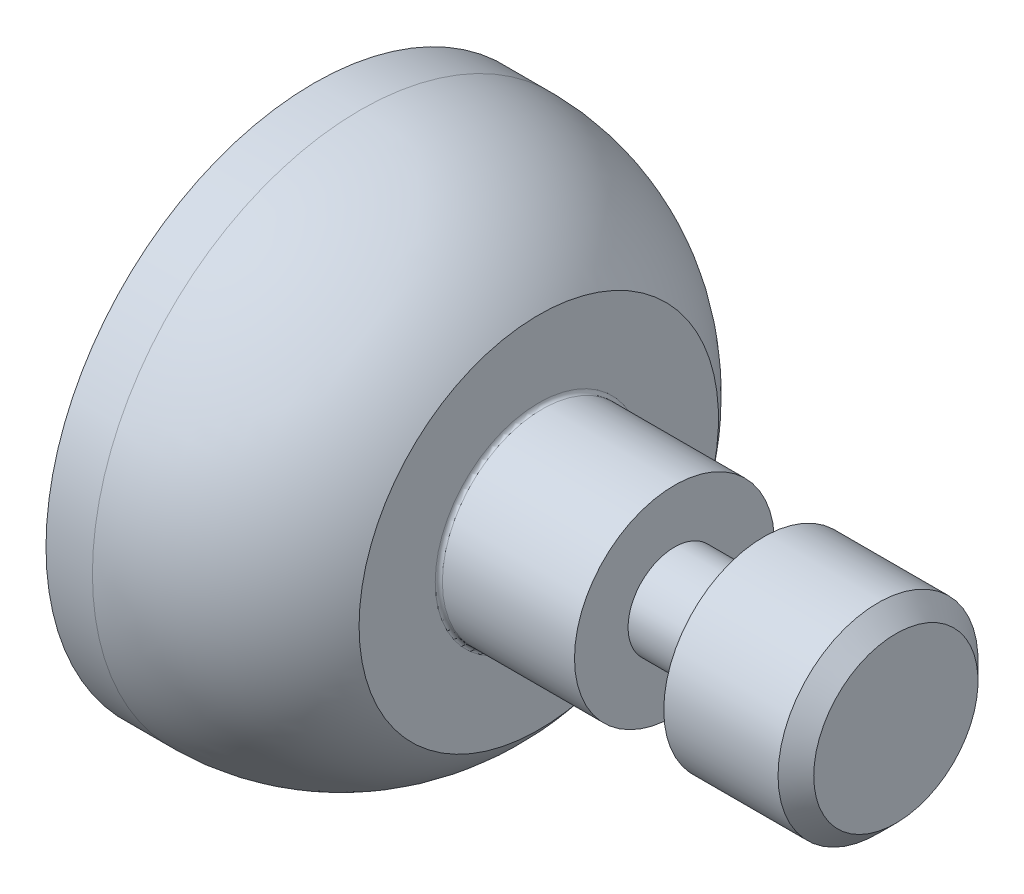
ISO-10303-21;
HEADER;
FILE_DESCRIPTION(('STEP AP214'),'2;1');
FILE_NAME('part.step','',(''),(''),'','','');
FILE_SCHEMA(('AUTOMOTIVE_DESIGN { 1 0 10303 214 1 1 1 1 }'));
ENDSEC;
DATA;
#1=APPLICATION_CONTEXT('core data for automotive mechanical design processes');
#2=APPLICATION_PROTOCOL_DEFINITION('international standard','automotive_design',2000,#1);
#3=PRODUCT_CONTEXT('',#1,'mechanical');
#4=PRODUCT('Part','Part','',(#3));
#5=PRODUCT_RELATED_PRODUCT_CATEGORY('part','',(#4));
#6=PRODUCT_DEFINITION_FORMATION('','',#4);
#7=PRODUCT_DEFINITION_CONTEXT('part definition',#1,'design');
#8=PRODUCT_DEFINITION('design','',#6,#7);
#9=PRODUCT_DEFINITION_SHAPE('','',#8);
#10=(LENGTH_UNIT() NAMED_UNIT(*) SI_UNIT(.MILLI.,.METRE.));
#11=(NAMED_UNIT(*) PLANE_ANGLE_UNIT() SI_UNIT($,.RADIAN.));
#12=(NAMED_UNIT(*) SI_UNIT($,.STERADIAN.) SOLID_ANGLE_UNIT());
#13=UNCERTAINTY_MEASURE_WITH_UNIT(LENGTH_MEASURE(1.E-05),#10,'distance_accuracy_value','');
#14=(GEOMETRIC_REPRESENTATION_CONTEXT(3) GLOBAL_UNCERTAINTY_ASSIGNED_CONTEXT((#13)) GLOBAL_UNIT_ASSIGNED_CONTEXT((#10,
#11,#12)) REPRESENTATION_CONTEXT('',''));
#15=CARTESIAN_POINT('',(0.,0.,0.));
#16=DIRECTION('',(0.,0.,1.));
#17=DIRECTION('',(1.,0.,0.));
#18=AXIS2_PLACEMENT_3D('',#15,#16,#17);
#19=CARTESIAN_POINT('',(1.63,0.28,0.));
#20=DIRECTION('',(-1.,0.,0.));
#21=DIRECTION('',(0.,0.,1.));
#22=AXIS2_PLACEMENT_3D('',#19,#20,#21);
#23=PLANE('',#22);
#24=CARTESIAN_POINT('',(1.63,0.,0.));
#25=DIRECTION('',(-1.,0.,0.));
#26=DIRECTION('',(0.,0.,1.));
#27=AXIS2_PLACEMENT_3D('',#24,#25,#26);
#28=CIRCLE('',#27,0.229999999999999);
#29=CARTESIAN_POINT('',(1.63,0.,0.229999999999999));
#30=VERTEX_POINT('',#29);
#31=EDGE_CURVE('E10',#30,#30,#28,.F.);
#32=ORIENTED_EDGE('',*,*,#31,.T.);
#33=EDGE_LOOP('',(#32));
#34=FACE_BOUND('',#33,.T.);
#35=ADVANCED_FACE('F43',(#34),#23,.F.);
#36=CARTESIAN_POINT('',(-1.69528566666492,0.,0.));
#37=DIRECTION('',(-1.,0.,0.));
#38=DIRECTION('',(0.,0.,1.));
#39=AXIS2_PLACEMENT_3D('',#36,#37,#38);
#40=CYLINDRICAL_SURFACE('',#39,0.28);
#41=CARTESIAN_POINT('',(1.58,0.,0.));
#42=DIRECTION('',(-1.,0.,0.));
#43=DIRECTION('',(0.,0.,1.));
#44=AXIS2_PLACEMENT_3D('',#41,#42,#43);
#45=CIRCLE('',#44,0.28);
#46=CARTESIAN_POINT('',(1.58,0.,0.28));
#47=VERTEX_POINT('',#46);
#48=EDGE_CURVE('E52',#47,#47,#45,.T.);
#49=ORIENTED_EDGE('',*,*,#48,.T.);
#50=EDGE_LOOP('',(#49));
#51=FACE_BOUND('',#50,.T.);
#52=CARTESIAN_POINT('',(1.26,0.,0.));
#53=DIRECTION('',(-1.,0.,0.));
#54=DIRECTION('',(0.,0.,1.));
#55=AXIS2_PLACEMENT_3D('',#52,#53,#54);
#56=CIRCLE('',#55,0.28);
#57=CARTESIAN_POINT('',(1.26,0.,0.28));
#58=VERTEX_POINT('',#57);
#59=EDGE_CURVE('E68',#58,#58,#56,.T.);
#60=ORIENTED_EDGE('',*,*,#59,.F.);
#61=EDGE_LOOP('',(#60));
#62=FACE_BOUND('',#61,.T.);
#63=ADVANCED_FACE('F123',(#51,#62),#40,.T.);
#64=CARTESIAN_POINT('',(1.26,0.13,0.));
#65=DIRECTION('',(1.,0.,0.));
#66=DIRECTION('',(0.,0.,-1.));
#67=AXIS2_PLACEMENT_3D('',#64,#65,#66);
#68=PLANE('',#67);
#69=CARTESIAN_POINT('',(1.26,0.,0.));
#70=DIRECTION('',(-1.,0.,0.));
#71=DIRECTION('',(0.,0.,1.));
#72=AXIS2_PLACEMENT_3D('',#69,#70,#71);
#73=CIRCLE('',#72,0.13);
#74=CARTESIAN_POINT('',(1.26,0.,0.13));
#75=VERTEX_POINT('',#74);
#76=EDGE_CURVE('E72',#75,#75,#73,.T.);
#77=ORIENTED_EDGE('',*,*,#76,.F.);
#78=EDGE_LOOP('',(#77));
#79=FACE_BOUND('',#78,.T.);
#80=ORIENTED_EDGE('',*,*,#59,.T.);
#81=EDGE_LOOP('',(#80));
#82=FACE_BOUND('',#81,.T.);
#83=ADVANCED_FACE('F128',(#79,#82),#68,.F.);
#84=CARTESIAN_POINT('',(-1.69528566666492,0.,0.));
#85=DIRECTION('',(-1.,0.,0.));
#86=DIRECTION('',(0.,0.,1.));
#87=AXIS2_PLACEMENT_3D('',#84,#85,#86);
#88=CYLINDRICAL_SURFACE('',#87,0.13);
#89=CARTESIAN_POINT('',(1.01,0.,0.));
#90=DIRECTION('',(-1.,0.,0.));
#91=DIRECTION('',(0.,0.,1.));
#92=AXIS2_PLACEMENT_3D('',#89,#90,#91);
#93=CIRCLE('',#92,0.13);
#94=CARTESIAN_POINT('',(1.01,0.,0.13));
#95=VERTEX_POINT('',#94);
#96=EDGE_CURVE('E76',#95,#95,#93,.T.);
#97=ORIENTED_EDGE('',*,*,#96,.F.);
#98=EDGE_LOOP('',(#97));
#99=FACE_BOUND('',#98,.T.);
#100=ORIENTED_EDGE('',*,*,#76,.T.);
#101=EDGE_LOOP('',(#100));
#102=FACE_BOUND('',#101,.T.);
#103=ADVANCED_FACE('F148',(#99,#102),#88,.T.);
#104=CARTESIAN_POINT('',(1.01,0.28,0.));
#105=DIRECTION('',(-1.,0.,0.));
#106=DIRECTION('',(0.,0.,1.));
#107=AXIS2_PLACEMENT_3D('',#104,#105,#106);
#108=PLANE('',#107);
#109=CARTESIAN_POINT('',(1.01,0.,0.));
#110=DIRECTION('',(-1.,0.,0.));
#111=DIRECTION('',(0.,0.,1.));
#112=AXIS2_PLACEMENT_3D('',#109,#110,#111);
#113=CIRCLE('',#112,0.28);
#114=CARTESIAN_POINT('',(1.01,0.,0.28));
#115=VERTEX_POINT('',#114);
#116=EDGE_CURVE('E80',#115,#115,#113,.T.);
#117=ORIENTED_EDGE('',*,*,#116,.F.);
#118=EDGE_LOOP('',(#117));
#119=FACE_BOUND('',#118,.T.);
#120=ORIENTED_EDGE('',*,*,#96,.T.);
#121=EDGE_LOOP('',(#120));
#122=FACE_BOUND('',#121,.T.);
#123=ADVANCED_FACE('F119',(#119,#122),#108,.F.);
#124=CARTESIAN_POINT('',(-1.69528566666492,0.,0.));
#125=DIRECTION('',(-1.,0.,0.));
#126=DIRECTION('',(0.,0.,1.));
#127=AXIS2_PLACEMENT_3D('',#124,#125,#126);
#128=CYLINDRICAL_SURFACE('',#127,0.28);
#129=CARTESIAN_POINT('',(0.64,0.,0.));
#130=DIRECTION('',(-1.,0.,0.));
#131=DIRECTION('',(0.,0.,1.));
#132=AXIS2_PLACEMENT_3D('',#129,#130,#131);
#133=CIRCLE('',#132,0.28);
#134=CARTESIAN_POINT('',(0.64,0.,0.28));
#135=VERTEX_POINT('',#134);
#136=EDGE_CURVE('E57',#135,#135,#133,.F.);
#137=ORIENTED_EDGE('',*,*,#136,.T.);
#138=EDGE_LOOP('',(#137));
#139=FACE_BOUND('',#138,.T.);
#140=ORIENTED_EDGE('',*,*,#116,.T.);
#141=EDGE_LOOP('',(#140));
#142=FACE_BOUND('',#141,.T.);
#143=ADVANCED_FACE('F113',(#139,#142),#128,.T.);
#144=CARTESIAN_POINT('',(0.63,0.503275357934736,0.));
#145=DIRECTION('',(-1.,0.,0.));
#146=DIRECTION('',(0.,0.,1.));
#147=AXIS2_PLACEMENT_3D('',#144,#145,#146);
#148=PLANE('',#147);
#149=CARTESIAN_POINT('',(0.63,0.,0.));
#150=DIRECTION('',(-1.,0.,0.));
#151=DIRECTION('',(0.,0.,1.));
#152=AXIS2_PLACEMENT_3D('',#149,#150,#151);
#153=CIRCLE('',#152,0.29);
#154=CARTESIAN_POINT('',(0.63,0.,0.29));
#155=VERTEX_POINT('',#154);
#156=EDGE_CURVE('E62',#155,#155,#153,.T.);
#157=ORIENTED_EDGE('',*,*,#156,.T.);
#158=EDGE_LOOP('',(#157));
#159=FACE_BOUND('',#158,.T.);
#160=CARTESIAN_POINT('',(0.63,0.,0.));
#161=DIRECTION('',(-1.,0.,0.));
#162=DIRECTION('',(0.,0.,1.));
#163=AXIS2_PLACEMENT_3D('',#160,#161,#162);
#164=CIRCLE('',#163,0.503275357934736);
#165=CARTESIAN_POINT('',(0.63,0.,0.503275357934736));
#166=VERTEX_POINT('',#165);
#167=EDGE_CURVE('E84',#166,#166,#164,.T.);
#168=ORIENTED_EDGE('',*,*,#167,.F.);
#169=EDGE_LOOP('',(#168));
#170=FACE_BOUND('',#169,.T.);
#171=ADVANCED_FACE('F108',(#159,#170),#148,.F.);
#172=CARTESIAN_POINT('',(0.13,0.,0.));
#173=DIRECTION('',(-1.,0.,0.));
#174=DIRECTION('',(0.,0.,1.));
#175=AXIS2_PLACEMENT_3D('',#172,#173,#174);
#176=DEGENERATE_TOROIDAL_SURFACE('',#175,0.12,0.63,.T.);
#177=CARTESIAN_POINT('',(0.13,0.,0.));
#178=DIRECTION('',(-1.,0.,0.));
#179=DIRECTION('',(0.,0.,1.));
#180=AXIS2_PLACEMENT_3D('',#177,#178,#179);
#181=CIRCLE('',#180,0.75);
#182=CARTESIAN_POINT('',(0.13,0.,0.75));
#183=VERTEX_POINT('',#182);
#184=EDGE_CURVE('E88',#183,#183,#181,.T.);
#185=ORIENTED_EDGE('',*,*,#184,.F.);
#186=EDGE_LOOP('',(#185));
#187=FACE_BOUND('',#186,.T.);
#188=ORIENTED_EDGE('',*,*,#167,.T.);
#189=EDGE_LOOP('',(#188));
#190=FACE_BOUND('',#189,.T.);
#191=ADVANCED_FACE('F102',(#187,#190),#176,.T.);
#192=CARTESIAN_POINT('',(-1.69528566666492,0.,0.));
#193=DIRECTION('',(-1.,0.,0.));
#194=DIRECTION('',(0.,0.,1.));
#195=AXIS2_PLACEMENT_3D('',#192,#193,#194);
#196=CYLINDRICAL_SURFACE('',#195,0.75);
#197=CARTESIAN_POINT('',(0.,0.,0.));
#198=DIRECTION('',(-1.,0.,0.));
#199=DIRECTION('',(0.,0.,1.));
#200=AXIS2_PLACEMENT_3D('',#197,#198,#199);
#201=CIRCLE('',#200,0.75);
#202=CARTESIAN_POINT('',(0.,0.,0.75));
#203=VERTEX_POINT('',#202);
#204=EDGE_CURVE('E92',#203,#203,#201,.T.);
#205=ORIENTED_EDGE('',*,*,#204,.F.);
#206=EDGE_LOOP('',(#205));
#207=FACE_BOUND('',#206,.T.);
#208=ORIENTED_EDGE('',*,*,#184,.T.);
#209=EDGE_LOOP('',(#208));
#210=FACE_BOUND('',#209,.T.);
#211=ADVANCED_FACE('F99',(#207,#210),#196,.T.);
#212=CARTESIAN_POINT('',(0.,0.,0.));
#213=DIRECTION('',(1.,0.,0.));
#214=DIRECTION('',(0.,0.,-1.));
#215=AXIS2_PLACEMENT_3D('',#212,#213,#214);
#216=PLANE('',#215);
#217=ORIENTED_EDGE('',*,*,#204,.T.);
#218=EDGE_LOOP('',(#217));
#219=FACE_BOUND('',#218,.T.);
#220=ADVANCED_FACE('F97',(#219),#216,.F.);
#221=CARTESIAN_POINT('',(0.64,0.,0.));
#222=DIRECTION('',(-1.,0.,0.));
#223=DIRECTION('',(0.,0.,1.));
#224=AXIS2_PLACEMENT_3D('',#221,#222,#223);
#225=TOROIDAL_SURFACE('',#224,0.29,0.01);
#226=ORIENTED_EDGE('',*,*,#136,.F.);
#227=EDGE_LOOP('',(#226));
#228=FACE_BOUND('',#227,.T.);
#229=ORIENTED_EDGE('',*,*,#156,.F.);
#230=EDGE_LOOP('',(#229));
#231=FACE_BOUND('',#230,.T.);
#232=ADVANCED_FACE('F131',(#228,#231),#225,.F.);
#233=CARTESIAN_POINT('',(1.58,0.,0.));
#234=DIRECTION('',(-1.,0.,0.));
#235=DIRECTION('',(0.,0.,1.));
#236=AXIS2_PLACEMENT_3D('',#233,#234,#235);
#237=CONICAL_SURFACE('',#236,0.28,0.785398163397456);
#238=ORIENTED_EDGE('',*,*,#31,.F.);
#239=EDGE_LOOP('',(#238));
#240=FACE_BOUND('',#239,.T.);
#241=ORIENTED_EDGE('',*,*,#48,.F.);
#242=EDGE_LOOP('',(#241));
#243=FACE_BOUND('',#242,.T.);
#244=ADVANCED_FACE('F46',(#240,#243),#237,.T.);
#245=CLOSED_SHELL('',(#35,#63,#83,#103,#123,#143,#171,#191,#211,#220,#232,#244));
#246=MANIFOLD_SOLID_BREP('B2',#245);
#247=ADVANCED_BREP_SHAPE_REPRESENTATION('',(#18,#246),#14);
#248=SHAPE_DEFINITION_REPRESENTATION(#9,#247);
ENDSEC;
END-ISO-10303-21;
